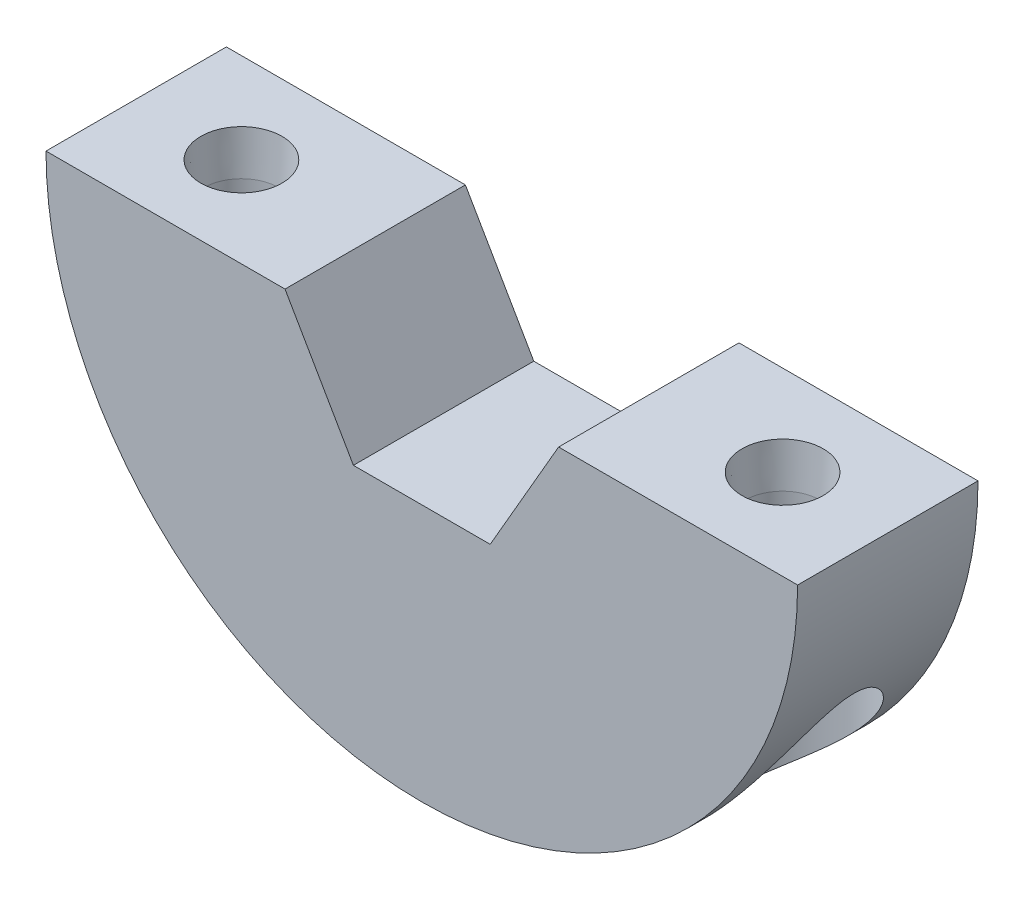
ISO-10303-21;
HEADER;
FILE_DESCRIPTION(('STEP AP214'),'2;1');
FILE_NAME('part.step','',(''),(''),'','','');
FILE_SCHEMA(('AUTOMOTIVE_DESIGN { 1 0 10303 214 1 1 1 1 }'));
ENDSEC;
DATA;
#1=APPLICATION_CONTEXT('core data for automotive mechanical design processes');
#2=APPLICATION_PROTOCOL_DEFINITION('international standard','automotive_design',2000,#1);
#3=PRODUCT_CONTEXT('',#1,'mechanical');
#4=PRODUCT('Part','Part','',(#3));
#5=PRODUCT_RELATED_PRODUCT_CATEGORY('part','',(#4));
#6=PRODUCT_DEFINITION_FORMATION('','',#4);
#7=PRODUCT_DEFINITION_CONTEXT('part definition',#1,'design');
#8=PRODUCT_DEFINITION('design','',#6,#7);
#9=PRODUCT_DEFINITION_SHAPE('','',#8);
#10=(LENGTH_UNIT() NAMED_UNIT(*) SI_UNIT(.MILLI.,.METRE.));
#11=(NAMED_UNIT(*) PLANE_ANGLE_UNIT() SI_UNIT($,.RADIAN.));
#12=(NAMED_UNIT(*) SI_UNIT($,.STERADIAN.) SOLID_ANGLE_UNIT());
#13=UNCERTAINTY_MEASURE_WITH_UNIT(LENGTH_MEASURE(1.E-05),#10,'distance_accuracy_value','');
#14=(GEOMETRIC_REPRESENTATION_CONTEXT(3) GLOBAL_UNCERTAINTY_ASSIGNED_CONTEXT((#13)) GLOBAL_UNIT_ASSIGNED_CONTEXT((#10,
#11,#12)) REPRESENTATION_CONTEXT('',''));
#15=CARTESIAN_POINT('',(0.,0.,0.));
#16=DIRECTION('',(0.,0.,1.));
#17=DIRECTION('',(1.,0.,0.));
#18=AXIS2_PLACEMENT_3D('',#15,#16,#17);
#19=CARTESIAN_POINT('',(0.,0.,12.));
#20=DIRECTION('',(0.,1.,0.));
#21=DIRECTION('',(-1.,0.,0.));
#22=AXIS2_PLACEMENT_3D('',#19,#20,#21);
#23=PLANE('',#22);
#24=CARTESIAN_POINT('',(-18.,0.,6.));
#25=DIRECTION('',(0.,1.,0.));
#26=DIRECTION('',(0.,0.,1.));
#27=AXIS2_PLACEMENT_3D('',#24,#25,#26);
#28=CIRCLE('',#27,2.7);
#29=CARTESIAN_POINT('',(-18.,0.,8.7));
#30=VERTEX_POINT('',#29);
#31=EDGE_CURVE('E302',#30,#30,#28,.T.);
#32=ORIENTED_EDGE('',*,*,#31,.F.);
#33=EDGE_LOOP('',(#32));
#34=FACE_BOUND('',#33,.T.);
#35=DIRECTION('',(0.,0.,1.));
#36=VECTOR('',#35,1.);
#37=CARTESIAN_POINT('',(-9.1,0.,-8.));
#38=LINE('',#37,#36);
#39=CARTESIAN_POINT('',(-9.1,0.,0.));
#40=VERTEX_POINT('',#39);
#41=CARTESIAN_POINT('',(-9.1,0.,12.));
#42=VERTEX_POINT('',#41);
#43=EDGE_CURVE('E173',#40,#42,#38,.T.);
#44=ORIENTED_EDGE('',*,*,#43,.F.);
#45=DIRECTION('',(1.,0.,0.));
#46=VECTOR('',#45,1.);
#47=CARTESIAN_POINT('',(0.,0.,0.));
#48=LINE('',#47,#46);
#49=CARTESIAN_POINT('',(-25.,0.,0.));
#50=VERTEX_POINT('',#49);
#51=EDGE_CURVE('E81',#50,#40,#48,.T.);
#52=ORIENTED_EDGE('',*,*,#51,.F.);
#53=DIRECTION('',(0.,0.,-1.));
#54=VECTOR('',#53,1.);
#55=CARTESIAN_POINT('',(-25.,0.,12.));
#56=LINE('',#55,#54);
#57=CARTESIAN_POINT('',(-25.,0.,12.));
#58=VERTEX_POINT('',#57);
#59=EDGE_CURVE('E88',#58,#50,#56,.T.);
#60=ORIENTED_EDGE('',*,*,#59,.F.);
#61=DIRECTION('',(1.,0.,0.));
#62=VECTOR('',#61,1.);
#63=CARTESIAN_POINT('',(0.,0.,12.));
#64=LINE('',#63,#62);
#65=EDGE_CURVE('E94',#58,#42,#64,.T.);
#66=ORIENTED_EDGE('',*,*,#65,.T.);
#67=EDGE_LOOP('',(#44,#52,#60,#66));
#68=FACE_BOUND('',#67,.T.);
#69=ADVANCED_FACE('F33',(#34,#68),#23,.T.);
#70=CARTESIAN_POINT('',(0.,0.,12.));
#71=DIRECTION('',(0.,0.,-1.));
#72=DIRECTION('',(-1.,0.,0.));
#73=AXIS2_PLACEMENT_3D('',#70,#71,#72);
#74=CYLINDRICAL_SURFACE('',#73,25.);
#75=CARTESIAN_POINT('',(0.,0.,0.));
#76=DIRECTION('',(0.,0.,1.));
#77=DIRECTION('',(1.,0.,0.));
#78=AXIS2_PLACEMENT_3D('',#75,#76,#77);
#79=CIRCLE('',#78,25.);
#80=CARTESIAN_POINT('',(25.,0.,0.));
#81=VERTEX_POINT('',#80);
#82=EDGE_CURVE('E78',#50,#81,#79,.T.);
#83=ORIENTED_EDGE('',*,*,#82,.T.);
#84=DIRECTION('',(0.,0.,-1.));
#85=VECTOR('',#84,1.);
#86=CARTESIAN_POINT('',(25.,0.,12.));
#87=LINE('',#86,#85);
#88=CARTESIAN_POINT('',(25.,0.,12.));
#89=VERTEX_POINT('',#88);
#90=EDGE_CURVE('E85',#89,#81,#87,.T.);
#91=ORIENTED_EDGE('',*,*,#90,.F.);
#92=CARTESIAN_POINT('',(0.,0.,12.));
#93=DIRECTION('',(0.,0.,1.));
#94=DIRECTION('',(1.,0.,0.));
#95=AXIS2_PLACEMENT_3D('',#92,#93,#94);
#96=CIRCLE('',#95,25.);
#97=EDGE_CURVE('E89',#58,#89,#96,.T.);
#98=ORIENTED_EDGE('',*,*,#97,.F.);
#99=ORIENTED_EDGE('',*,*,#59,.T.);
#100=EDGE_LOOP('',(#83,#91,#98,#99));
#101=FACE_BOUND('',#100,.T.);
#102=CARTESIAN_POINT('',(-13.25,-21.1999410376539,6.));
#103=CARTESIAN_POINT('',(-13.2500009354019,-21.1999406878279,6.11699361126747));
#104=CARTESIAN_POINT('',(-13.254329216846,-21.1972371754924,6.23402318464072));
#105=CARTESIAN_POINT('',(-13.2715892849546,-21.1864347706166,6.46724693337123));
#106=CARTESIAN_POINT('',(-13.2845263192154,-21.1783325872301,6.58344055546743));
#107=CARTESIAN_POINT('',(-13.3188614661342,-21.156756385658,6.81430009601783));
#108=CARTESIAN_POINT('',(-13.3402758904643,-21.1432720109755,6.92896262614904));
#109=CARTESIAN_POINT('',(-13.3912818987238,-21.1110037272912,7.15573854865243));
#110=CARTESIAN_POINT('',(-13.4208767862804,-21.0922176771776,7.26785089130886));
#111=CARTESIAN_POINT('',(-13.4877234802794,-21.0495339680623,7.48831511482083));
#112=CARTESIAN_POINT('',(-13.5249476383107,-21.0256547542797,7.59667896758992));
#113=CARTESIAN_POINT('',(-13.6066522648071,-20.9728724424999,7.80941552965167));
#114=CARTESIAN_POINT('',(-13.6511354506462,-20.9439674628706,7.91378672618618));
#115=CARTESIAN_POINT('',(-13.7467560236759,-20.8813304174432,8.11780463726225));
#116=CARTESIAN_POINT('',(-13.7978875611386,-20.8476025925809,8.21745540125836));
#117=CARTESIAN_POINT('',(-13.9062526325002,-20.7754753346104,8.4116600733157));
#118=CARTESIAN_POINT('',(-13.963488487261,-20.737074123892,8.50621202208845));
#119=CARTESIAN_POINT('',(-14.0857997976982,-20.6541983185497,8.69342275965967));
#120=CARTESIAN_POINT('',(-14.1510963333156,-20.609543082356,8.78585720595197));
#121=CARTESIAN_POINT('',(-14.286863595557,-20.5156612952178,8.96440800309845));
#122=CARTESIAN_POINT('',(-14.3573361722325,-20.4664331081011,9.05052207268236));
#123=CARTESIAN_POINT('',(-14.5754125344253,-20.3122850329553,9.29896746350432));
#124=CARTESIAN_POINT('',(-14.7297410009443,-20.2008573709025,9.45150136157468));
#125=CARTESIAN_POINT('',(-15.0715415792244,-19.947420684545,9.74757458625588));
#126=CARTESIAN_POINT('',(-15.2607078111097,-19.8033178528879,9.8873229239578));
#127=CARTESIAN_POINT('',(-15.6477876780748,-19.4989073588987,10.1330624700875));
#128=CARTESIAN_POINT('',(-15.8457075787858,-19.3385879800196,10.2390290381733));
#129=CARTESIAN_POINT('',(-16.1966937988227,-19.0448500843349,10.3975300670112));
#130=CARTESIAN_POINT('',(-16.3491287740354,-18.9142057815718,10.4567843545121));
#131=CARTESIAN_POINT('',(-16.6540017985108,-18.6463236661506,10.5581351479274));
#132=CARTESIAN_POINT('',(-16.8064398250081,-18.5090832586319,10.6002248386214));
#133=CARTESIAN_POINT('',(-17.1099828528766,-18.2288572510288,10.6684700869027));
#134=CARTESIAN_POINT('',(-17.2610854409109,-18.0858631319094,10.6946010154074));
#135=CARTESIAN_POINT('',(-17.5605725224289,-17.7952201388657,10.7320373061075));
#136=CARTESIAN_POINT('',(-17.7089570101369,-17.6475712550523,10.7433426368035));
#137=CARTESIAN_POINT('',(-18.0544368448399,-17.2950273527785,10.7538547165131));
#138=CARTESIAN_POINT('',(-18.2500402159195,-17.0884881729503,10.7473118971728));
#139=CARTESIAN_POINT('',(-18.6331558278659,-16.6699159608359,10.7115445224366));
#140=CARTESIAN_POINT('',(-18.8206649309713,-16.4578808481199,10.6823112529236));
#141=CARTESIAN_POINT('',(-19.1869419801842,-16.0293753810103,10.6031351371525));
#142=CARTESIAN_POINT('',(-19.3656897090265,-15.812896266367,10.5531467010035));
#143=CARTESIAN_POINT('',(-19.7132970062764,-15.3773714032695,10.4340575810996));
#144=CARTESIAN_POINT('',(-19.8821581255631,-15.1583260638747,10.3649599047324));
#145=CARTESIAN_POINT('',(-20.2138995288947,-14.7131689242193,10.2066405988469));
#146=CARTESIAN_POINT('',(-20.3765032712382,-14.487023525325,10.1169347965738));
#147=CARTESIAN_POINT('',(-20.6904914179785,-14.0349320035801,9.91895748953908));
#148=CARTESIAN_POINT('',(-20.8418718817817,-13.8089859779867,9.81067950771928));
#149=CARTESIAN_POINT('',(-21.1323660699509,-13.3601757561718,9.57569181058597));
#150=CARTESIAN_POINT('',(-21.271522626339,-13.1373033117989,9.44905094313801));
#151=CARTESIAN_POINT('',(-21.5374325046671,-12.6966542030495,9.17576074722187));
#152=CARTESIAN_POINT('',(-21.664196575785,-12.4788732493839,9.02912902792398));
#153=CARTESIAN_POINT('',(-21.8688173008568,-12.1154721798532,8.75940716808045));
#154=CARTESIAN_POINT('',(-21.9500841674756,-11.9674861532958,8.64209836968467));
#155=CARTESIAN_POINT('',(-22.1051545044403,-11.6785694472158,8.39408371559209));
#156=CARTESIAN_POINT('',(-22.1789509259205,-11.5376454933773,8.26336543698906));
#157=CARTESIAN_POINT('',(-22.3181462314386,-11.2660459974773,7.98508632160629));
#158=CARTESIAN_POINT('',(-22.3834736873633,-11.135460841697,7.83739984270066));
#159=CARTESIAN_POINT('',(-22.5023927019266,-10.8931341922735,7.52286486122829));
#160=CARTESIAN_POINT('',(-22.5560117611926,-10.781348687322,7.35606269518182));
#161=CARTESIAN_POINT('',(-22.6292542178805,-10.6264377545541,7.07004939623825));
#162=CARTESIAN_POINT('',(-22.6539915572203,-10.5735111764626,6.95753061390808));
#163=CARTESIAN_POINT('',(-22.6958294089708,-10.4834054626948,6.72498179192325));
#164=CARTESIAN_POINT('',(-22.7129400398013,-10.446205465827,6.60496194663774));
#165=CARTESIAN_POINT('',(-22.7381202171049,-10.3912877297424,6.35808565193586));
#166=CARTESIAN_POINT('',(-22.7460908824269,-10.3737831032211,6.23116970914938));
#167=CARTESIAN_POINT('',(-22.7516494744591,-10.3615881835076,5.976021373475));
#168=CARTESIAN_POINT('',(-22.7492426685988,-10.3668863160167,5.84778968140732));
#169=CARTESIAN_POINT('',(-22.7352571717261,-10.3975132949949,5.60956631487095));
#170=CARTESIAN_POINT('',(-22.7247736096511,-10.4204498995295,5.49918287150956));
#171=CARTESIAN_POINT('',(-22.6969067432075,-10.4810082773915,5.28346781198287));
#172=CARTESIAN_POINT('',(-22.6795181422513,-10.5186413234212,5.17814014358652));
#173=CARTESIAN_POINT('',(-22.6266976195214,-10.6319517987696,4.91179418122354));
#174=CARTESIAN_POINT('',(-22.586714877977,-10.7168696281492,4.75565299910817));
#175=CARTESIAN_POINT('',(-22.4958510281896,-10.9063181932321,4.45920831247828));
#176=CARTESIAN_POINT('',(-22.4449336004843,-11.0109141425141,4.31896002739254));
#177=CARTESIAN_POINT('',(-22.3379021453648,-11.2263893322185,4.06000868374535));
#178=CARTESIAN_POINT('',(-22.282239921856,-11.336586850286,3.94053831449832));
#179=CARTESIAN_POINT('',(-22.1647633773839,-11.564589926391,3.71226313024808));
#180=CARTESIAN_POINT('',(-22.1029435594737,-11.6824022487046,3.60346802026611));
#181=CARTESIAN_POINT('',(-21.9738724977856,-11.9234081879797,3.39502796761796));
#182=CARTESIAN_POINT('',(-21.906611610977,-12.0466111730844,3.29539997008017));
#183=CARTESIAN_POINT('',(-21.767233703556,-12.2966678883586,3.10441270248893));
#184=CARTESIAN_POINT('',(-21.6951150790548,-12.4235228163029,3.01305618701664));
#185=CARTESIAN_POINT('',(-21.5534974873549,-12.6674658341735,2.84628111571731));
#186=CARTESIAN_POINT('',(-21.4844100638528,-12.7843245427717,2.77017422865398));
#187=CARTESIAN_POINT('',(-21.3427048986731,-13.019516721512,2.62373000395637));
#188=CARTESIAN_POINT('',(-21.2700866799992,-13.1378503893005,2.5533934493394));
#189=CARTESIAN_POINT('',(-21.0470426240449,-13.4944634565356,2.35054789029208));
#190=CARTESIAN_POINT('',(-20.8914791694907,-13.734265286629,2.22626326769473));
#191=CARTESIAN_POINT('',(-20.5671451956764,-14.2153763251394,1.99855699105954));
#192=CARTESIAN_POINT('',(-20.3983547453717,-14.4566872838532,1.89516769581605));
#193=CARTESIAN_POINT('',(-20.0482833214578,-14.9383712993096,1.70974982024675));
#194=CARTESIAN_POINT('',(-19.8670058443466,-15.1787445988474,1.62771529086287));
#195=CARTESIAN_POINT('',(-19.4877702564626,-15.6628126904491,1.48434330428315));
#196=CARTESIAN_POINT('',(-19.2895076325066,-15.906439372965,1.42357714371428));
#197=CARTESIAN_POINT('',(-18.8811865912738,-16.3890417731589,1.3277425944479));
#198=CARTESIAN_POINT('',(-18.6711244495453,-16.6280159898957,1.29268236931628));
#199=CARTESIAN_POINT('',(-18.241438851167,-17.0982745243457,1.25124927359453));
#200=CARTESIAN_POINT('',(-18.0218528338888,-17.329583588021,1.24477282266115));
#201=CARTESIAN_POINT('',(-17.5747000244676,-17.7828846398276,1.26379785662965));
#202=CARTESIAN_POINT('',(-17.3471407948291,-18.0048850402892,1.28926979643284));
#203=CARTESIAN_POINT('',(-16.9876684565419,-18.3425982408364,1.35725329164989));
#204=CARTESIAN_POINT('',(-16.8572780361854,-18.4624796671354,1.38750633743316));
#205=CARTESIAN_POINT('',(-16.595902553966,-18.6977774422552,1.46024197795689));
#206=CARTESIAN_POINT('',(-16.464917692399,-18.8131951859776,1.50272071655763));
#207=CARTESIAN_POINT('',(-16.2034977619288,-19.0388144265724,1.60062011099519));
#208=CARTESIAN_POINT('',(-16.0730622953568,-19.1490206690221,1.65602870896698));
#209=CARTESIAN_POINT('',(-15.8138988435529,-19.3635968651238,1.78050754493232));
#210=CARTESIAN_POINT('',(-15.6851706198249,-19.4679676406634,1.8495758527957));
#211=CARTESIAN_POINT('',(-15.4530593376354,-19.6525055553983,1.98869304451981));
#212=CARTESIAN_POINT('',(-15.3491597430166,-19.733726596979,2.05648515510098));
#213=CARTESIAN_POINT('',(-15.1445804525924,-19.8911621585377,2.20199671411209));
#214=CARTESIAN_POINT('',(-15.043900101826,-19.9673777002627,2.27971412694442));
#215=CARTESIAN_POINT('',(-14.8468152062052,-20.1143530305677,2.44521607458763));
#216=CARTESIAN_POINT('',(-14.7504122945434,-20.1851107427496,2.53300440953557));
#217=CARTESIAN_POINT('',(-14.5631840110677,-20.32060578758,2.71851386169925));
#218=CARTESIAN_POINT('',(-14.4723557564243,-20.3853462410043,2.81622977443443));
#219=CARTESIAN_POINT('',(-14.2967062686355,-20.5089207315197,3.02231443341052));
#220=CARTESIAN_POINT('',(-14.2119477398346,-20.5676951791753,3.13077262888041));
#221=CARTESIAN_POINT('',(-14.0507681614034,-20.6781396395015,3.35701957524692));
#222=CARTESIAN_POINT('',(-13.9743427599072,-20.7298133641367,3.47480339993978));
#223=CARTESIAN_POINT('',(-13.8311392864606,-20.8256335491979,3.71896361483323));
#224=CARTESIAN_POINT('',(-13.7643592430729,-20.8697815481579,3.8453382413519));
#225=CARTESIAN_POINT('',(-13.641715397521,-20.9501547597748,4.10565608725514));
#226=CARTESIAN_POINT('',(-13.585847969124,-20.9863826047564,4.23959677331967));
#227=CARTESIAN_POINT('',(-13.4975571729755,-21.0432420901423,4.48237904920694));
#228=CARTESIAN_POINT('',(-13.4626944204873,-21.0655456404271,4.5899518014429));
#229=CARTESIAN_POINT('',(-13.4005561960702,-21.1051286050147,4.80816220820095));
#230=CARTESIAN_POINT('',(-13.3732793932162,-21.1224089006519,4.91879932134281));
#231=CARTESIAN_POINT('',(-13.3267216901485,-21.1518142400603,5.1421235243731));
#232=CARTESIAN_POINT('',(-13.3074212971357,-21.1639518534044,5.25480490576434));
#233=CARTESIAN_POINT('',(-13.2769817790156,-21.1830611827573,5.48165460069746));
#234=CARTESIAN_POINT('',(-13.2658381667204,-21.190035739078,5.59582206148387));
#235=CARTESIAN_POINT('',(-13.2558965262563,-21.1962547553955,5.75850957231967));
#236=CARTESIAN_POINT('',(-13.2536861937864,-21.1976367881579,5.80676667225135));
#237=CARTESIAN_POINT('',(-13.2507376786771,-21.1994800383067,5.9033471325171));
#238=CARTESIAN_POINT('',(-13.2499996135899,-21.1999411821653,5.95167049783386));
#239=CARTESIAN_POINT('',(-13.25,-21.1999410376539,6.));
#240=B_SPLINE_CURVE_WITH_KNOTS('',3,(#102,#103,#104,#105,#106,#107,#108,#109,#110,#111,#112,
#113,#114,#115,#116,#117,#118,#119,#120,#121,#122,#123,#124,#125,#126,#127,#128,#129,#130,#131,
#132,#133,#134,#135,#136,#137,#138,#139,#140,#141,#142,#143,#144,#145,#146,#147,#148,#149,#150,
#151,#152,#153,#154,#155,#156,#157,#158,#159,#160,#161,#162,#163,#164,#165,#166,#167,#168,#169,
#170,#171,#172,#173,#174,#175,#176,#177,#178,#179,#180,#181,#182,#183,#184,#185,#186,#187,#188,
#189,#190,#191,#192,#193,#194,#195,#196,#197,#198,#199,#200,#201,#202,#203,#204,#205,#206,#207,
#208,#209,#210,#211,#212,#213,#214,#215,#216,#217,#218,#219,#220,#221,#222,#223,#224,#225,#226,
#227,#228,#229,#230,#231,#232,#233,#234,#235,#236,#237,#238,#239),.UNSPECIFIED.,.T.,.F.,(4,2,2,
2,2,2,2,2,2,2,2,2,2,2,2,2,2,2,2,2,2,2,2,2,2,2,2,2,2,2,2,2,2,2,2,2,2,2,2,2,2,2,2,2,2,2,2,2,2,2,2,
2,2,2,2,2,2,2,2,2,2,2,2,2,2,2,2,2,4),(0.,0.350932395108258,0.702078902587325,1.05390437442424,
1.40587213681482,1.756586236082,2.10743192553503,2.45797097709546,2.80864378197495,
3.17324432714769,3.53797583021591,4.2670608987449,5.09158260882387,5.91670435432483,
6.54386243070996,7.17126927896304,7.79964197044317,8.42801599700388,9.28039302255181,
10.1330975599203,10.9876851036359,11.8421382299215,12.7192038399887,13.5965759514331,
14.4707397438035,15.3441384351196,15.9603638767177,16.5771654522522,17.1988708305209,
17.8190998566371,18.1983272543907,18.5770500193446,18.9598324669248,19.3424206434634,
19.6806756079479,20.0191905374485,20.5625889642787,21.1078209979625,21.6224641739728,
22.1375709664219,22.6536115540613,23.1698233670147,23.6365531452379,24.103346152933,
25.0372903508475,25.9726699684845,26.9077887264485,27.8663833945075,28.8252823566938,
29.7807036442648,30.7352420324393,31.2739148938159,31.8124180367426,32.3504209862222,
32.8883479696116,33.3327823504932,33.7771257274901,34.2216373268752,34.6659170842167,
35.1142698625594,35.5623873616356,36.0104131389237,36.4582897842191,36.8036948407531,
37.1490392590394,37.4935346595156,37.8378404043218,37.9827973275033,38.1277658242084),.UNSPECIFIED.);
#241=CARTESIAN_POINT('',(-13.25,-21.1999410376539,6.));
#242=VERTEX_POINT('',#241);
#243=EDGE_CURVE('E100',#242,#242,#240,.T.);
#244=ORIENTED_EDGE('',*,*,#243,.F.);
#245=EDGE_LOOP('',(#244));
#246=FACE_BOUND('',#245,.T.);
#247=CARTESIAN_POINT('',(22.75,-10.3652062208139,6.));
#248=CARTESIAN_POINT('',(22.7499961113231,-10.3652157460256,6.12468859413371));
#249=CARTESIAN_POINT('',(22.7450330329192,-10.3761286580684,6.24940715359003));
#250=CARTESIAN_POINT('',(22.7257835312809,-10.4182177096908,6.49465860071015));
#251=CARTESIAN_POINT('',(22.7114822906056,-10.4494260529703,6.61518451496497));
#252=CARTESIAN_POINT('',(22.669619292818,-10.5399941061508,6.8835296586202));
#253=CARTESIAN_POINT('',(22.6394015168304,-10.6049197975806,7.02901267415249));
#254=CARTESIAN_POINT('',(22.5689118041685,-10.7541159158818,7.30700239678459));
#255=CARTESIAN_POINT('',(22.528615000358,-10.8384341462995,7.43947586371124));
#256=CARTESIAN_POINT('',(22.4452692630456,-11.0099033503599,7.6781561258962));
#257=CARTESIAN_POINT('',(22.4030242396947,-11.0956974544844,7.78564579522137));
#258=CARTESIAN_POINT('',(22.3135161196162,-11.2746181075511,7.99217423809719));
#259=CARTESIAN_POINT('',(22.2662489442565,-11.3677506001002,8.09120602320398));
#260=CARTESIAN_POINT('',(22.1673478455518,-11.5594270808454,8.28194446724592));
#261=CARTESIAN_POINT('',(22.1157051700238,-11.6579817700007,8.37363569536278));
#262=CARTESIAN_POINT('',(22.0085965668554,-11.8589482219823,8.550358749749));
#263=CARTESIAN_POINT('',(21.9531292633295,-11.9613613667899,8.63538815572337));
#264=CARTESIAN_POINT('',(21.8401222619028,-12.1664468490836,8.79740457240781));
#265=CARTESIAN_POINT('',(21.7826673047989,-12.2690506207323,8.87453812479589));
#266=CARTESIAN_POINT('',(21.6646459844125,-12.4762715221856,9.02355688726718));
#267=CARTESIAN_POINT('',(21.6040790877577,-12.5808889951948,9.09544119250685));
#268=CARTESIAN_POINT('',(21.4178673005493,-12.8970820954551,9.30385735251405));
#269=CARTESIAN_POINT('',(21.2877670724562,-13.1108966732022,9.43307376186886));
#270=CARTESIAN_POINT('',(21.0163447394845,-13.5417227886593,9.67383655169166));
#271=CARTESIAN_POINT('',(20.8750075381726,-13.7587382968788,9.7853585370178));
#272=CARTESIAN_POINT('',(20.5817431330251,-14.1936824175262,9.99113631105808));
#273=CARTESIAN_POINT('',(20.4298192171709,-14.4116107268705,10.0853974278825));
#274=CARTESIAN_POINT('',(20.1055296484165,-14.8610009538046,10.2621018740825));
#275=CARTESIAN_POINT('',(19.9324773302149,-15.0924252382498,10.3433843870892));
#276=CARTESIAN_POINT('',(19.5751701882688,-15.5530603600922,10.4853419586707));
#277=CARTESIAN_POINT('',(19.3909127760451,-15.7822706717612,10.5460122341459));
#278=CARTESIAN_POINT('',(19.0122915633935,-16.2363785316114,10.644994732471));
#279=CARTESIAN_POINT('',(18.8179490823113,-16.4612839038772,10.6833521819225));
#280=CARTESIAN_POINT('',(18.4198875893481,-16.9055187615565,10.7356584031932));
#281=CARTESIAN_POINT('',(18.2161730421305,-17.1248508262395,10.7496186762588));
#282=CARTESIAN_POINT('',(17.8658487803355,-17.488678082969,10.7502491031801));
#283=CARTESIAN_POINT('',(17.7212802449799,-17.635147351509,10.744082111938));
#284=CARTESIAN_POINT('',(17.4292235925413,-17.9238470097372,10.7178604091131));
#285=CARTESIAN_POINT('',(17.2817362222447,-18.066078460926,10.6978092063131));
#286=CARTESIAN_POINT('',(16.9848952735841,-18.3454302416287,10.6427172058519));
#287=CARTESIAN_POINT('',(16.8355432069368,-18.4825543926591,10.6076878708381));
#288=CARTESIAN_POINT('',(16.5362122526755,-18.7508437535575,10.5215142099884));
#289=CARTESIAN_POINT('',(16.3862335085521,-18.8820102537918,10.4703733929621));
#290=CARTESIAN_POINT('',(15.9999475863977,-19.2119274999024,10.3159274634747));
#291=CARTESIAN_POINT('',(15.7642348562063,-19.4055481345034,10.1995883800047));
#292=CARTESIAN_POINT('',(15.3038755033557,-19.7706247106368,9.91992298684296));
#293=CARTESIAN_POINT('',(15.0792159080971,-19.9421070385608,9.75665337654332));
#294=CARTESIAN_POINT('',(14.6889605437399,-20.2307409347821,9.41389955706697));
#295=CARTESIAN_POINT('',(14.519863994807,-20.3521611777091,9.2420812738994));
#296=CARTESIAN_POINT('',(14.2834419275701,-20.5181051804719,8.96053736174411));
#297=CARTESIAN_POINT('',(14.2074754852497,-20.5707416586088,8.86267180312228));
#298=CARTESIAN_POINT('',(14.0622545264122,-20.6702860333511,8.65936821191464));
#299=CARTESIAN_POINT('',(13.9929971399149,-20.7171963817171,8.55393345116695));
#300=CARTESIAN_POINT('',(13.8617215825189,-20.8052631470334,8.33527851945653));
#301=CARTESIAN_POINT('',(13.7997551117892,-20.8463788377087,8.22201085020829));
#302=CARTESIAN_POINT('',(13.6845826190075,-20.9221641043629,7.98910493119963));
#303=CARTESIAN_POINT('',(13.6313724752709,-20.9568367141587,7.86946971400272));
#304=CARTESIAN_POINT('',(13.534556932593,-21.0194932755625,7.62469639156626));
#305=CARTESIAN_POINT('',(13.4909504333401,-21.0474779934489,7.49955891870564));
#306=CARTESIAN_POINT('',(13.4140889753694,-21.096547139644,7.24483388194905));
#307=CARTESIAN_POINT('',(13.3808327605349,-21.1176324052901,7.11524686017404));
#308=CARTESIAN_POINT('',(13.3283430185731,-21.1507948575861,6.86737894932452));
#309=CARTESIAN_POINT('',(13.3079633730992,-21.1636117257402,6.7494380134081));
#310=CARTESIAN_POINT('',(13.2761424791783,-21.1835878988119,6.51188565617463));
#311=CARTESIAN_POINT('',(13.2647005312778,-21.1907476464496,6.39227436632337));
#312=CARTESIAN_POINT('',(13.2509246136524,-21.1993646814688,6.15236644140629));
#313=CARTESIAN_POINT('',(13.2485874832904,-21.2008239477101,6.03207005868811));
#314=CARTESIAN_POINT('',(13.2530469870083,-21.1980365370323,5.79171341472768));
#315=CARTESIAN_POINT('',(13.2598434384812,-21.1937899741894,5.67165314881281));
#316=CARTESIAN_POINT('',(13.281851001196,-21.1800044884401,5.43924706122729));
#317=CARTESIAN_POINT('',(13.2965831298665,-21.1707667360036,5.32683752667624));
#318=CARTESIAN_POINT('',(13.3339342757262,-21.1472618418089,5.1038327074398));
#319=CARTESIAN_POINT('',(13.3565558433032,-21.1329930736776,4.99323802155299));
#320=CARTESIAN_POINT('',(13.4093836368354,-21.0995119895979,4.77469425588132));
#321=CARTESIAN_POINT('',(13.439586567758,-21.0803018212047,4.66674404905983));
#322=CARTESIAN_POINT('',(13.5072155417599,-21.0370325682366,4.45408802265651));
#323=CARTESIAN_POINT('',(13.5446442943239,-21.0129716646187,4.3493834372396));
#324=CARTESIAN_POINT('',(13.6269680287644,-20.9596799591979,4.14211625315414));
#325=CARTESIAN_POINT('',(13.6719797274932,-20.9303677956039,4.03962088883338));
#326=CARTESIAN_POINT('',(13.7684632729102,-20.8670255196067,3.83921617032169));
#327=CARTESIAN_POINT('',(13.8199374450115,-20.8329937084537,3.74130848443281));
#328=CARTESIAN_POINT('',(13.9831668626636,-20.7240950927507,3.45527252549898));
#329=CARTESIAN_POINT('',(14.1037932819421,-20.6423840924633,3.2746722200117));
#330=CARTESIAN_POINT('',(14.3741640685141,-20.455135348122,2.92281159385359));
#331=CARTESIAN_POINT('',(14.5254849620801,-20.3481932955078,2.75353128547183));
#332=CARTESIAN_POINT('',(14.8436120409157,-20.1172999198721,2.44344545567753));
#333=CARTESIAN_POINT('',(15.0104272588333,-19.9933386548583,2.30265669778242));
#334=CARTESIAN_POINT('',(15.3028382986107,-19.7698344953885,2.08715253070901));
#335=CARTESIAN_POINT('',(15.4260095024463,-19.6739331590717,2.00521772616728));
#336=CARTESIAN_POINT('',(15.6755527629793,-19.4756878433677,1.8550459294707));
#337=CARTESIAN_POINT('',(15.8019257945722,-19.3733418872785,1.78681316717087));
#338=CARTESIAN_POINT('',(16.0565224774947,-19.1628654217924,1.66347634998524));
#339=CARTESIAN_POINT('',(16.1847483259081,-19.0547275478576,1.60838952013243));
#340=CARTESIAN_POINT('',(16.4416969452081,-18.8334641347977,1.51078121147726));
#341=CARTESIAN_POINT('',(16.5704198339032,-18.720337337349,1.46826292382832));
#342=CARTESIAN_POINT('',(16.870464689552,-18.4510302517346,1.3828060602247));
#343=CARTESIAN_POINT('',(17.0415853912011,-18.2931422321317,1.34451502758321));
#344=CARTESIAN_POINT('',(17.3810118914415,-17.9709556658643,1.28735812223917));
#345=CARTESIAN_POINT('',(17.5493167617366,-17.80665506242,1.26849853603462));
#346=CARTESIAN_POINT('',(17.8819002095811,-17.4726428897426,1.24854380820775));
#347=CARTESIAN_POINT('',(18.0461739107835,-17.3029252883659,1.24746921555126));
#348=CARTESIAN_POINT('',(18.3694839354265,-16.9592968174444,1.26162837451465));
#349=CARTESIAN_POINT('',(18.5285202516754,-16.7853859421421,1.27686214852766));
#350=CARTESIAN_POINT('',(18.8919238666091,-16.376584363831,1.32978762103923));
#351=CARTESIAN_POINT('',(19.094032961033,-16.1404176130651,1.37321019678318));
#352=CARTESIAN_POINT('',(19.4867097544129,-15.6640835084635,1.48404584647132));
#353=CARTESIAN_POINT('',(19.6772726100931,-15.4239145289474,1.55146890742965));
#354=CARTESIAN_POINT('',(20.0463423993795,-14.9411049963189,1.70869749269407));
#355=CARTESIAN_POINT('',(20.2248318304353,-14.6984614180064,1.7985346621909));
#356=CARTESIAN_POINT('',(20.5688797306513,-14.2130085746329,1.99961618768152));
#357=CARTESIAN_POINT('',(20.7344432003106,-13.970199410668,2.11085220711101));
#358=CARTESIAN_POINT('',(21.0062015023448,-13.5566154836807,2.31957896521639));
#359=CARTESIAN_POINT('',(21.1157193998091,-13.3853145591075,2.4117425826137));
#360=CARTESIAN_POINT('',(21.3277183504516,-13.0448687918161,2.6074186446321));
#361=CARTESIAN_POINT('',(21.4302007477879,-12.8757235423054,2.71092891156605));
#362=CARTESIAN_POINT('',(21.6273793129173,-12.5416878105748,2.92978151186665));
#363=CARTESIAN_POINT('',(21.7221036443214,-12.3767835790667,3.04507728821861));
#364=CARTESIAN_POINT('',(21.9035235589544,-12.0528019931473,3.28925331348785));
#365=CARTESIAN_POINT('',(21.9902247985181,-11.8937205821786,3.41812385291034));
#366=CARTESIAN_POINT('',(22.1429612219189,-11.6065451528839,3.67251854293552));
#367=CARTESIAN_POINT('',(22.2101868018197,-11.4772439143102,3.79595411368462));
#368=CARTESIAN_POINT('',(22.3369058766383,-11.2286261094052,4.05709435985574));
#369=CARTESIAN_POINT('',(22.3963815830507,-11.1093327302273,4.1948306028833));
#370=CARTESIAN_POINT('',(22.478388046871,-10.9419405540603,4.41483053284862));
#371=CARTESIAN_POINT('',(22.5046930940028,-10.887702850716,4.49102459808801));
#372=CARTESIAN_POINT('',(22.5542692426493,-10.784627737974,4.64799630560681));
#373=CARTESIAN_POINT('',(22.5775395915597,-10.7357916686342,4.72877507779055));
#374=CARTESIAN_POINT('',(22.6204014394045,-10.6451841406533,4.89469783482863));
#375=CARTESIAN_POINT('',(22.6400086193005,-10.6033826491193,4.97982112988131));
#376=CARTESIAN_POINT('',(22.6749994703381,-10.5283480381961,5.15453573757828));
#377=CARTESIAN_POINT('',(22.6903874064556,-10.4951062683924,5.24412242935853));
#378=CARTESIAN_POINT('',(22.7184119484684,-10.4343221447026,5.44259031630026));
#379=CARTESIAN_POINT('',(22.7301597689753,-10.4086590117465,5.55219499598806));
#380=CARTESIAN_POINT('',(22.7459521221997,-10.3741042124672,5.77452686483087));
#381=CARTESIAN_POINT('',(22.7500035163098,-10.3651976077057,5.88725118175498));
#382=CARTESIAN_POINT('',(22.75,-10.3652062208139,6.));
#383=B_SPLINE_CURVE_WITH_KNOTS('',3,(#247,#248,#249,#250,#251,#252,#253,#254,#255,#256,#257,
#258,#259,#260,#261,#262,#263,#264,#265,#266,#267,#268,#269,#270,#271,#272,#273,#274,#275,#276,
#277,#278,#279,#280,#281,#282,#283,#284,#285,#286,#287,#288,#289,#290,#291,#292,#293,#294,#295,
#296,#297,#298,#299,#300,#301,#302,#303,#304,#305,#306,#307,#308,#309,#310,#311,#312,#313,#314,
#315,#316,#317,#318,#319,#320,#321,#322,#323,#324,#325,#326,#327,#328,#329,#330,#331,#332,#333,
#334,#335,#336,#337,#338,#339,#340,#341,#342,#343,#344,#345,#346,#347,#348,#349,#350,#351,#352,
#353,#354,#355,#356,#357,#358,#359,#360,#361,#362,#363,#364,#365,#366,#367,#368,#369,#370,#371,
#372,#373,#374,#375,#376,#377,#378,#379,#380,#381,#382),.UNSPECIFIED.,.T.,.F.,(4,2,2,2,2,2,2,2,
2,2,2,2,2,2,2,2,2,2,2,2,2,2,2,2,2,2,2,2,2,2,2,2,2,2,2,2,2,2,2,2,2,2,2,2,2,2,2,2,2,2,2,2,2,2,2,2,
2,2,2,2,2,2,2,2,2,2,2,4),(0.,0.373589983631673,0.747774210939525,1.23147451189708,
1.7163801853103,2.14738150316458,2.57873556431251,3.01097379686985,3.44336834388236,
3.86510858509811,4.28692135338228,5.1309660246572,5.97616444632173,6.82110152947539,
7.72076302412634,8.62063314416497,9.51867287446036,10.4162891391491,11.0334969860517,
11.6505489106452,12.2671294530351,12.8835758072786,13.8590466118246,14.8333438137153,
15.6394322101788,16.0428305526569,16.4460555614016,16.8519865446787,17.2577259025069,
17.663418749635,18.0690623424241,18.4297191973231,18.7903478248138,19.1508512528861,
19.5113474735483,19.8521889149411,20.1931406410907,20.5339444376848,20.8748762754329,
21.2216374343709,21.5685237290752,22.2617728288881,23.0118643880121,23.7623960020683,
24.2906414779621,24.8190497747299,25.3481466860313,25.8773778199034,26.5842164675273,
27.2912837211791,27.9991678707032,28.7070529922294,29.6473282946031,30.5879953199395,
31.5299980095654,32.4716344542518,33.1409710519078,33.8101794124047,34.4768394530536,
35.1430258547982,35.7153133859071,36.2888921953135,36.5801188919585,36.8714176759475,
37.1614393954315,37.4511668597314,37.7892846516237,38.1271008685382),.UNSPECIFIED.);
#384=CARTESIAN_POINT('',(22.75,-10.3652062208139,6.));
#385=VERTEX_POINT('',#384);
#386=EDGE_CURVE('E82',#385,#385,#383,.T.);
#387=ORIENTED_EDGE('',*,*,#386,.F.);
#388=EDGE_LOOP('',(#387));
#389=FACE_BOUND('',#388,.T.);
#390=ADVANCED_FACE('F91',(#101,#246,#389),#74,.T.);
#391=CARTESIAN_POINT('',(18.,0.,6.));
#392=DIRECTION('',(0.,1.,0.));
#393=DIRECTION('',(0.,0.,1.));
#394=AXIS2_PLACEMENT_3D('',#391,#392,#393);
#395=CIRCLE('',#394,2.7);
#396=CARTESIAN_POINT('',(18.,0.,8.7));
#397=VERTEX_POINT('',#396);
#398=EDGE_CURVE('E147',#397,#397,#395,.T.);
#399=ORIENTED_EDGE('',*,*,#398,.F.);
#400=EDGE_LOOP('',(#399));
#401=FACE_BOUND('',#400,.T.);
#402=DIRECTION('',(0.,0.,1.));
#403=VECTOR('',#402,1.);
#404=CARTESIAN_POINT('',(9.1,0.,-8.));
#405=LINE('',#404,#403);
#406=CARTESIAN_POINT('',(9.1,0.,0.));
#407=VERTEX_POINT('',#406);
#408=CARTESIAN_POINT('',(9.1,0.,12.));
#409=VERTEX_POINT('',#408);
#410=EDGE_CURVE('E167',#407,#409,#405,.T.);
#411=ORIENTED_EDGE('',*,*,#410,.T.);
#412=EDGE_CURVE('E59',#409,#89,#64,.T.);
#413=ORIENTED_EDGE('',*,*,#412,.T.);
#414=ORIENTED_EDGE('',*,*,#90,.T.);
#415=EDGE_CURVE('E73',#407,#81,#48,.T.);
#416=ORIENTED_EDGE('',*,*,#415,.F.);
#417=EDGE_LOOP('',(#411,#413,#414,#416));
#418=FACE_BOUND('',#417,.T.);
#419=ADVANCED_FACE('F35',(#401,#418),#23,.T.);
#420=CARTESIAN_POINT('',(0.,0.,12.));
#421=DIRECTION('',(0.,0.,1.));
#422=DIRECTION('',(1.,0.,0.));
#423=AXIS2_PLACEMENT_3D('',#420,#421,#422);
#424=PLANE('',#423);
#425=DIRECTION('',(0.5,0.866025403784439,0.));
#426=VECTOR('',#425,1.);
#427=CARTESIAN_POINT('',(4.55,-7.8808311744384,12.));
#428=LINE('',#427,#426);
#429=CARTESIAN_POINT('',(4.55,-7.8808311744384,12.));
#430=VERTEX_POINT('',#429);
#431=EDGE_CURVE('E159',#430,#409,#428,.T.);
#432=ORIENTED_EDGE('',*,*,#431,.F.);
#433=DIRECTION('',(1.,0.,0.));
#434=VECTOR('',#433,1.);
#435=CARTESIAN_POINT('',(-4.55,-7.88083117443839,12.));
#436=LINE('',#435,#434);
#437=CARTESIAN_POINT('',(-4.55,-7.88083117443839,12.));
#438=VERTEX_POINT('',#437);
#439=EDGE_CURVE('E164',#438,#430,#436,.T.);
#440=ORIENTED_EDGE('',*,*,#439,.F.);
#441=DIRECTION('',(0.5,-0.866025403784439,0.));
#442=VECTOR('',#441,1.);
#443=CARTESIAN_POINT('',(-9.1,0.,12.));
#444=LINE('',#443,#442);
#445=EDGE_CURVE('E162',#42,#438,#444,.T.);
#446=ORIENTED_EDGE('',*,*,#445,.F.);
#447=ORIENTED_EDGE('',*,*,#65,.F.);
#448=ORIENTED_EDGE('',*,*,#97,.T.);
#449=ORIENTED_EDGE('',*,*,#412,.F.);
#450=EDGE_LOOP('',(#432,#440,#446,#447,#448,#449));
#451=FACE_BOUND('',#450,.T.);
#452=ADVANCED_FACE('F127',(#451),#424,.T.);
#453=CARTESIAN_POINT('',(0.,0.,0.));
#454=DIRECTION('',(0.,0.,1.));
#455=DIRECTION('',(1.,0.,0.));
#456=AXIS2_PLACEMENT_3D('',#453,#454,#455);
#457=PLANE('',#456);
#458=DIRECTION('',(1.,0.,0.));
#459=VECTOR('',#458,1.);
#460=CARTESIAN_POINT('',(0.,-7.8808311744384,0.));
#461=LINE('',#460,#459);
#462=CARTESIAN_POINT('',(-4.55,-7.88083117443839,0.));
#463=VERTEX_POINT('',#462);
#464=CARTESIAN_POINT('',(4.55,-7.8808311744384,0.));
#465=VERTEX_POINT('',#464);
#466=EDGE_CURVE('E42',#463,#465,#461,.T.);
#467=ORIENTED_EDGE('',*,*,#466,.T.);
#468=DIRECTION('',(0.5,0.866025403784439,0.));
#469=VECTOR('',#468,1.);
#470=CARTESIAN_POINT('',(6.825,-3.94041558721919,0.));
#471=LINE('',#470,#469);
#472=EDGE_CURVE('E11',#465,#407,#471,.T.);
#473=ORIENTED_EDGE('',*,*,#472,.T.);
#474=ORIENTED_EDGE('',*,*,#415,.T.);
#475=ORIENTED_EDGE('',*,*,#82,.F.);
#476=ORIENTED_EDGE('',*,*,#51,.T.);
#477=DIRECTION('',(0.5,-0.866025403784439,0.));
#478=VECTOR('',#477,1.);
#479=CARTESIAN_POINT('',(-6.825,-3.9404155872192,0.));
#480=LINE('',#479,#478);
#481=EDGE_CURVE('E99',#40,#463,#480,.T.);
#482=ORIENTED_EDGE('',*,*,#481,.T.);
#483=EDGE_LOOP('',(#467,#473,#474,#475,#476,#482));
#484=FACE_BOUND('',#483,.T.);
#485=ADVANCED_FACE('F75',(#484),#457,.F.);
#486=CARTESIAN_POINT('',(-18.,-5.,6.));
#487=DIRECTION('',(0.,-1.,0.));
#488=DIRECTION('',(1.,0.,0.));
#489=AXIS2_PLACEMENT_3D('',#486,#487,#488);
#490=CYLINDRICAL_SURFACE('',#489,4.75);
#491=CARTESIAN_POINT('',(-18.,-5.,6.));
#492=DIRECTION('',(0.,1.,0.));
#493=DIRECTION('',(-1.,0.,0.));
#494=AXIS2_PLACEMENT_3D('',#491,#492,#493);
#495=CIRCLE('',#494,4.75);
#496=CARTESIAN_POINT('',(-22.75,-5.,6.));
#497=VERTEX_POINT('',#496);
#498=EDGE_CURVE('E171',#497,#497,#495,.T.);
#499=ORIENTED_EDGE('',*,*,#498,.T.);
#500=EDGE_LOOP('',(#499));
#501=FACE_BOUND('',#500,.T.);
#502=ORIENTED_EDGE('',*,*,#243,.T.);
#503=EDGE_LOOP('',(#502));
#504=FACE_BOUND('',#503,.T.);
#505=ADVANCED_FACE('F115',(#501,#504),#490,.F.);
#506=CARTESIAN_POINT('',(-18.,-5.,6.));
#507=DIRECTION('',(0.,1.,0.));
#508=DIRECTION('',(-1.,0.,0.));
#509=AXIS2_PLACEMENT_3D('',#506,#507,#508);
#510=PLANE('',#509);
#511=CARTESIAN_POINT('',(-18.,-5.,6.));
#512=DIRECTION('',(0.,1.,0.));
#513=DIRECTION('',(-1.,0.,0.));
#514=AXIS2_PLACEMENT_3D('',#511,#512,#513);
#515=CIRCLE('',#514,2.5);
#516=CARTESIAN_POINT('',(-20.5,-5.,6.));
#517=VERTEX_POINT('',#516);
#518=EDGE_CURVE('E37',#517,#517,#515,.T.);
#519=ORIENTED_EDGE('',*,*,#518,.T.);
#520=EDGE_LOOP('',(#519));
#521=FACE_BOUND('',#520,.T.);
#522=ORIENTED_EDGE('',*,*,#498,.F.);
#523=EDGE_LOOP('',(#522));
#524=FACE_BOUND('',#523,.T.);
#525=ADVANCED_FACE('F119',(#521,#524),#510,.F.);
#526=CARTESIAN_POINT('',(18.,-5.,6.));
#527=DIRECTION('',(0.,-1.,0.));
#528=DIRECTION('',(1.,0.,0.));
#529=AXIS2_PLACEMENT_3D('',#526,#527,#528);
#530=CYLINDRICAL_SURFACE('',#529,4.75);
#531=CARTESIAN_POINT('',(18.,-5.,6.));
#532=DIRECTION('',(0.,1.,0.));
#533=DIRECTION('',(-1.,0.,0.));
#534=AXIS2_PLACEMENT_3D('',#531,#532,#533);
#535=CIRCLE('',#534,4.75);
#536=CARTESIAN_POINT('',(13.25,-5.,6.));
#537=VERTEX_POINT('',#536);
#538=EDGE_CURVE('E107',#537,#537,#535,.T.);
#539=ORIENTED_EDGE('',*,*,#538,.T.);
#540=EDGE_LOOP('',(#539));
#541=FACE_BOUND('',#540,.T.);
#542=ORIENTED_EDGE('',*,*,#386,.T.);
#543=EDGE_LOOP('',(#542));
#544=FACE_BOUND('',#543,.T.);
#545=ADVANCED_FACE('F121',(#541,#544),#530,.F.);
#546=CARTESIAN_POINT('',(0.,-5.,0.));
#547=DIRECTION('',(0.,1.,0.));
#548=DIRECTION('',(-1.,0.,0.));
#549=AXIS2_PLACEMENT_3D('',#546,#547,#548);
#550=PLANE('',#549);
#551=CARTESIAN_POINT('',(18.,-5.,6.));
#552=DIRECTION('',(0.,1.,0.));
#553=DIRECTION('',(-1.,0.,0.));
#554=AXIS2_PLACEMENT_3D('',#551,#552,#553);
#555=CIRCLE('',#554,2.5);
#556=CARTESIAN_POINT('',(15.5,-5.,6.));
#557=VERTEX_POINT('',#556);
#558=EDGE_CURVE('E152',#557,#557,#555,.T.);
#559=ORIENTED_EDGE('',*,*,#558,.T.);
#560=EDGE_LOOP('',(#559));
#561=FACE_BOUND('',#560,.T.);
#562=ORIENTED_EDGE('',*,*,#538,.F.);
#563=EDGE_LOOP('',(#562));
#564=FACE_BOUND('',#563,.T.);
#565=ADVANCED_FACE('F218',(#561,#564),#550,.F.);
#566=CARTESIAN_POINT('',(4.55,-7.8808311744384,-8.));
#567=DIRECTION('',(0.866025403784439,-0.5,0.));
#568=DIRECTION('',(0.5,0.866025403784439,0.));
#569=AXIS2_PLACEMENT_3D('',#566,#567,#568);
#570=PLANE('',#569);
#571=DIRECTION('',(0.,0.,1.));
#572=VECTOR('',#571,1.);
#573=CARTESIAN_POINT('',(4.55,-7.8808311744384,-8.));
#574=LINE('',#573,#572);
#575=EDGE_CURVE('E168',#465,#430,#574,.T.);
#576=ORIENTED_EDGE('',*,*,#575,.T.);
#577=ORIENTED_EDGE('',*,*,#431,.T.);
#578=ORIENTED_EDGE('',*,*,#410,.F.);
#579=ORIENTED_EDGE('',*,*,#472,.F.);
#580=EDGE_LOOP('',(#576,#577,#578,#579));
#581=FACE_BOUND('',#580,.T.);
#582=ADVANCED_FACE('F200',(#581),#570,.F.);
#583=CARTESIAN_POINT('',(-4.55,-7.88083117443839,-8.));
#584=DIRECTION('',(0.,-1.,0.));
#585=DIRECTION('',(1.,0.,0.));
#586=AXIS2_PLACEMENT_3D('',#583,#584,#585);
#587=PLANE('',#586);
#588=DIRECTION('',(0.,0.,1.));
#589=VECTOR('',#588,1.);
#590=CARTESIAN_POINT('',(-4.55,-7.88083117443839,-8.));
#591=LINE('',#590,#589);
#592=EDGE_CURVE('E50',#463,#438,#591,.T.);
#593=ORIENTED_EDGE('',*,*,#592,.T.);
#594=ORIENTED_EDGE('',*,*,#439,.T.);
#595=ORIENTED_EDGE('',*,*,#575,.F.);
#596=ORIENTED_EDGE('',*,*,#466,.F.);
#597=EDGE_LOOP('',(#593,#594,#595,#596));
#598=FACE_BOUND('',#597,.T.);
#599=ADVANCED_FACE('F203',(#598),#587,.F.);
#600=CARTESIAN_POINT('',(-9.1,0.,-8.));
#601=DIRECTION('',(-0.866025403784439,-0.5,0.));
#602=DIRECTION('',(0.5,-0.866025403784439,0.));
#603=AXIS2_PLACEMENT_3D('',#600,#601,#602);
#604=PLANE('',#603);
#605=ORIENTED_EDGE('',*,*,#43,.T.);
#606=ORIENTED_EDGE('',*,*,#445,.T.);
#607=ORIENTED_EDGE('',*,*,#592,.F.);
#608=ORIENTED_EDGE('',*,*,#481,.F.);
#609=EDGE_LOOP('',(#605,#606,#607,#608));
#610=FACE_BOUND('',#609,.T.);
#611=ADVANCED_FACE('F205',(#610),#604,.F.);
#612=CARTESIAN_POINT('',(18.,0.,6.));
#613=DIRECTION('',(0.,1.,0.));
#614=DIRECTION('',(0.,0.,1.));
#615=AXIS2_PLACEMENT_3D('',#612,#613,#614);
#616=CYLINDRICAL_SURFACE('',#615,2.5);
#617=CARTESIAN_POINT('',(18.,-2.86013325134246,6.));
#618=DIRECTION('',(0.,1.,0.));
#619=DIRECTION('',(0.,0.,1.));
#620=AXIS2_PLACEMENT_3D('',#617,#618,#619);
#621=CIRCLE('',#620,2.5);
#622=CARTESIAN_POINT('',(18.,-2.86013325134246,8.49999999999999));
#623=VERTEX_POINT('',#622);
#624=EDGE_CURVE('E149',#623,#623,#621,.T.);
#625=ORIENTED_EDGE('',*,*,#624,.T.);
#626=EDGE_LOOP('',(#625));
#627=FACE_BOUND('',#626,.T.);
#628=ORIENTED_EDGE('',*,*,#558,.F.);
#629=EDGE_LOOP('',(#628));
#630=FACE_BOUND('',#629,.T.);
#631=ADVANCED_FACE('F207',(#627,#630),#616,.F.);
#632=CARTESIAN_POINT('',(18.,0.,6.));
#633=DIRECTION('',(0.,1.,0.));
#634=DIRECTION('',(0.,0.,1.));
#635=AXIS2_PLACEMENT_3D('',#632,#633,#634);
#636=CONICAL_SURFACE('',#635,2.7,0.0698131700797735);
#637=ORIENTED_EDGE('',*,*,#624,.F.);
#638=EDGE_LOOP('',(#637));
#639=FACE_BOUND('',#638,.T.);
#640=ORIENTED_EDGE('',*,*,#398,.T.);
#641=EDGE_LOOP('',(#640));
#642=FACE_BOUND('',#641,.T.);
#643=ADVANCED_FACE('F212',(#639,#642),#636,.F.);
#644=CARTESIAN_POINT('',(-18.,0.,6.));
#645=DIRECTION('',(0.,1.,0.));
#646=DIRECTION('',(0.,0.,1.));
#647=AXIS2_PLACEMENT_3D('',#644,#645,#646);
#648=CYLINDRICAL_SURFACE('',#647,2.5);
#649=CARTESIAN_POINT('',(-18.,-2.86013325134245,6.));
#650=DIRECTION('',(0.,1.,0.));
#651=DIRECTION('',(0.,0.,1.));
#652=AXIS2_PLACEMENT_3D('',#649,#650,#651);
#653=CIRCLE('',#652,2.5);
#654=CARTESIAN_POINT('',(-18.,-2.86013325134245,8.5));
#655=VERTEX_POINT('',#654);
#656=EDGE_CURVE('E155',#655,#655,#653,.T.);
#657=ORIENTED_EDGE('',*,*,#656,.T.);
#658=EDGE_LOOP('',(#657));
#659=FACE_BOUND('',#658,.T.);
#660=ORIENTED_EDGE('',*,*,#518,.F.);
#661=EDGE_LOOP('',(#660));
#662=FACE_BOUND('',#661,.T.);
#663=ADVANCED_FACE('F274',(#659,#662),#648,.F.);
#664=CARTESIAN_POINT('',(-18.,0.,6.));
#665=DIRECTION('',(0.,1.,0.));
#666=DIRECTION('',(0.,0.,1.));
#667=AXIS2_PLACEMENT_3D('',#664,#665,#666);
#668=CONICAL_SURFACE('',#667,2.7,0.0698131700797729);
#669=ORIENTED_EDGE('',*,*,#656,.F.);
#670=EDGE_LOOP('',(#669));
#671=FACE_BOUND('',#670,.T.);
#672=ORIENTED_EDGE('',*,*,#31,.T.);
#673=EDGE_LOOP('',(#672));
#674=FACE_BOUND('',#673,.T.);
#675=ADVANCED_FACE('F283',(#671,#674),#668,.F.);
#676=CLOSED_SHELL('',(#69,#390,#419,#452,#485,#505,#525,#545,#565,#582,#599,#611,#631,#643,#663,#675));
#677=MANIFOLD_SOLID_BREP('B2',#676);
#678=ADVANCED_BREP_SHAPE_REPRESENTATION('',(#18,#677),#14);
#679=SHAPE_DEFINITION_REPRESENTATION(#9,#678);
ENDSEC;
END-ISO-10303-21;
